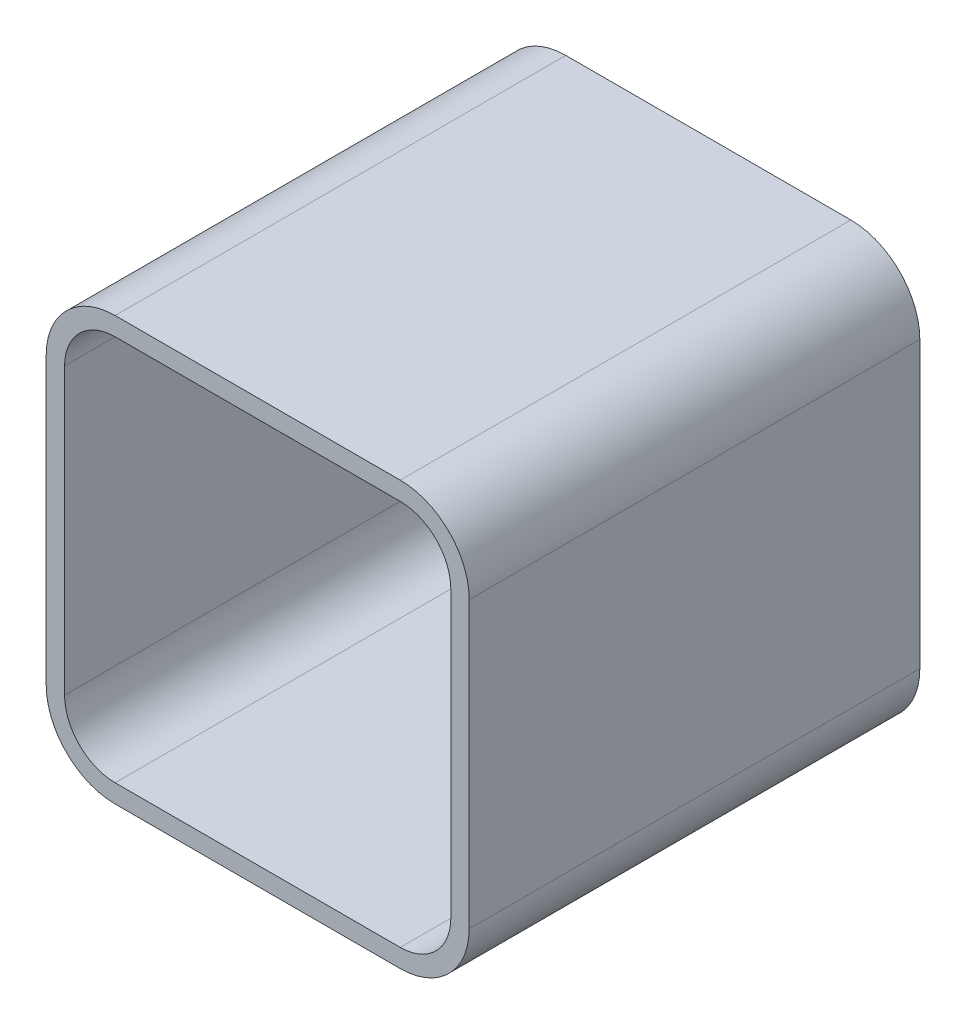
ISO-10303-21;
HEADER;
FILE_DESCRIPTION(('STEP AP214'),'2;1');
FILE_NAME('part.step','',(''),(''),'','','');
FILE_SCHEMA(('AUTOMOTIVE_DESIGN { 1 0 10303 214 1 1 1 1 }'));
ENDSEC;
DATA;
#1=APPLICATION_CONTEXT('core data for automotive mechanical design processes');
#2=APPLICATION_PROTOCOL_DEFINITION('international standard','automotive_design',2000,#1);
#3=PRODUCT_CONTEXT('',#1,'mechanical');
#4=PRODUCT('Part','Part','',(#3));
#5=PRODUCT_RELATED_PRODUCT_CATEGORY('part','',(#4));
#6=PRODUCT_DEFINITION_FORMATION('','',#4);
#7=PRODUCT_DEFINITION_CONTEXT('part definition',#1,'design');
#8=PRODUCT_DEFINITION('design','',#6,#7);
#9=PRODUCT_DEFINITION_SHAPE('','',#8);
#10=(LENGTH_UNIT() NAMED_UNIT(*) SI_UNIT(.MILLI.,.METRE.));
#11=(NAMED_UNIT(*) PLANE_ANGLE_UNIT() SI_UNIT($,.RADIAN.));
#12=(NAMED_UNIT(*) SI_UNIT($,.STERADIAN.) SOLID_ANGLE_UNIT());
#13=UNCERTAINTY_MEASURE_WITH_UNIT(LENGTH_MEASURE(1.E-05),#10,'distance_accuracy_value','');
#14=(GEOMETRIC_REPRESENTATION_CONTEXT(3) GLOBAL_UNCERTAINTY_ASSIGNED_CONTEXT((#13)) GLOBAL_UNIT_ASSIGNED_CONTEXT((#10,
#11,#12)) REPRESENTATION_CONTEXT('',''));
#15=CARTESIAN_POINT('',(0.,0.,0.));
#16=DIRECTION('',(0.,0.,1.));
#17=DIRECTION('',(1.,0.,0.));
#18=AXIS2_PLACEMENT_3D('',#15,#16,#17);
#19=CARTESIAN_POINT('',(0.,0.,2.));
#20=DIRECTION('',(0.,0.,1.));
#21=DIRECTION('',(1.,0.,0.));
#22=AXIS2_PLACEMENT_3D('',#19,#20,#21);
#23=PLANE('',#22);
#24=DIRECTION('',(0.,-1.,0.));
#25=VECTOR('',#24,1.);
#26=CARTESIAN_POINT('',(-21.,-21.,2.));
#27=LINE('',#26,#25);
#28=CARTESIAN_POINT('',(-21.,15.5,2.));
#29=VERTEX_POINT('',#28);
#30=CARTESIAN_POINT('',(-21.,-15.5,2.));
#31=VERTEX_POINT('',#30);
#32=EDGE_CURVE('E170',#29,#31,#27,.T.);
#33=ORIENTED_EDGE('',*,*,#32,.T.);
#34=CARTESIAN_POINT('',(-15.5,-15.5,2.));
#35=DIRECTION('',(0.,0.,1.));
#36=DIRECTION('',(1.,0.,0.));
#37=AXIS2_PLACEMENT_3D('',#34,#35,#36);
#38=CIRCLE('',#37,5.5);
#39=CARTESIAN_POINT('',(-15.5,-21.,2.));
#40=VERTEX_POINT('',#39);
#41=EDGE_CURVE('E11',#31,#40,#38,.T.);
#42=ORIENTED_EDGE('',*,*,#41,.T.);
#43=DIRECTION('',(1.,0.,0.));
#44=VECTOR('',#43,1.);
#45=CARTESIAN_POINT('',(21.,-21.,2.));
#46=LINE('',#45,#44);
#47=CARTESIAN_POINT('',(15.5,-21.,2.));
#48=VERTEX_POINT('',#47);
#49=EDGE_CURVE('E265',#40,#48,#46,.T.);
#50=ORIENTED_EDGE('',*,*,#49,.T.);
#51=CARTESIAN_POINT('',(15.5,-15.5,2.));
#52=DIRECTION('',(0.,0.,1.));
#53=DIRECTION('',(1.,0.,0.));
#54=AXIS2_PLACEMENT_3D('',#51,#52,#53);
#55=CIRCLE('',#54,5.5);
#56=CARTESIAN_POINT('',(21.,-15.5,2.));
#57=VERTEX_POINT('',#56);
#58=EDGE_CURVE('E49',#48,#57,#55,.T.);
#59=ORIENTED_EDGE('',*,*,#58,.T.);
#60=DIRECTION('',(0.,1.,0.));
#61=VECTOR('',#60,1.);
#62=CARTESIAN_POINT('',(21.,-21.,2.));
#63=LINE('',#62,#61);
#64=CARTESIAN_POINT('',(21.,15.5,2.));
#65=VERTEX_POINT('',#64);
#66=EDGE_CURVE('E268',#57,#65,#63,.T.);
#67=ORIENTED_EDGE('',*,*,#66,.T.);
#68=CARTESIAN_POINT('',(15.5,15.5,2.));
#69=DIRECTION('',(0.,0.,1.));
#70=DIRECTION('',(1.,0.,0.));
#71=AXIS2_PLACEMENT_3D('',#68,#69,#70);
#72=CIRCLE('',#71,5.5);
#73=CARTESIAN_POINT('',(15.5,21.,2.));
#74=VERTEX_POINT('',#73);
#75=EDGE_CURVE('E274',#65,#74,#72,.T.);
#76=ORIENTED_EDGE('',*,*,#75,.T.);
#77=DIRECTION('',(-1.,0.,0.));
#78=VECTOR('',#77,1.);
#79=CARTESIAN_POINT('',(21.,21.,2.));
#80=LINE('',#79,#78);
#81=CARTESIAN_POINT('',(-15.5,21.,2.));
#82=VERTEX_POINT('',#81);
#83=EDGE_CURVE('E271',#74,#82,#80,.T.);
#84=ORIENTED_EDGE('',*,*,#83,.T.);
#85=CARTESIAN_POINT('',(-15.5,15.5,2.));
#86=DIRECTION('',(0.,0.,1.));
#87=DIRECTION('',(1.,0.,0.));
#88=AXIS2_PLACEMENT_3D('',#85,#86,#87);
#89=CIRCLE('',#88,5.5);
#90=EDGE_CURVE('E277',#82,#29,#89,.T.);
#91=ORIENTED_EDGE('',*,*,#90,.T.);
#92=EDGE_LOOP('',(#33,#42,#50,#59,#67,#76,#84,#91));
#93=FACE_BOUND('',#92,.T.);
#94=ADVANCED_FACE('F41',(#93),#23,.T.);
#95=CARTESIAN_POINT('',(-15.5,15.5,49.));
#96=DIRECTION('',(0.,0.,1.));
#97=DIRECTION('',(1.,0.,0.));
#98=AXIS2_PLACEMENT_3D('',#95,#96,#97);
#99=PLANE('',#98);
#100=CARTESIAN_POINT('',(-15.5,15.5,49.));
#101=DIRECTION('',(0.,0.,1.));
#102=DIRECTION('',(1.,0.,0.));
#103=AXIS2_PLACEMENT_3D('',#100,#101,#102);
#104=CIRCLE('',#103,7.5);
#105=CARTESIAN_POINT('',(-15.5,23.,49.));
#106=VERTEX_POINT('',#105);
#107=CARTESIAN_POINT('',(-23.,15.5,49.));
#108=VERTEX_POINT('',#107);
#109=EDGE_CURVE('E207',#106,#108,#104,.T.);
#110=ORIENTED_EDGE('',*,*,#109,.T.);
#111=DIRECTION('',(0.,-1.,0.));
#112=VECTOR('',#111,1.);
#113=CARTESIAN_POINT('',(-23.,15.5,49.));
#114=LINE('',#113,#112);
#115=CARTESIAN_POINT('',(-23.,-15.5,49.));
#116=VERTEX_POINT('',#115);
#117=EDGE_CURVE('E210',#108,#116,#114,.T.);
#118=ORIENTED_EDGE('',*,*,#117,.T.);
#119=CARTESIAN_POINT('',(-15.5,-15.5,49.));
#120=DIRECTION('',(0.,0.,1.));
#121=DIRECTION('',(1.,0.,0.));
#122=AXIS2_PLACEMENT_3D('',#119,#120,#121);
#123=CIRCLE('',#122,7.5);
#124=CARTESIAN_POINT('',(-15.5,-23.,49.));
#125=VERTEX_POINT('',#124);
#126=EDGE_CURVE('E213',#116,#125,#123,.T.);
#127=ORIENTED_EDGE('',*,*,#126,.T.);
#128=DIRECTION('',(1.,0.,0.));
#129=VECTOR('',#128,1.);
#130=CARTESIAN_POINT('',(-15.5,-23.,49.));
#131=LINE('',#130,#129);
#132=CARTESIAN_POINT('',(15.5,-23.,49.));
#133=VERTEX_POINT('',#132);
#134=EDGE_CURVE('E215',#125,#133,#131,.T.);
#135=ORIENTED_EDGE('',*,*,#134,.T.);
#136=CARTESIAN_POINT('',(15.5,-15.5,49.));
#137=DIRECTION('',(0.,0.,1.));
#138=DIRECTION('',(1.,0.,0.));
#139=AXIS2_PLACEMENT_3D('',#136,#137,#138);
#140=CIRCLE('',#139,7.5);
#141=CARTESIAN_POINT('',(23.,-15.5,49.));
#142=VERTEX_POINT('',#141);
#143=EDGE_CURVE('E217',#133,#142,#140,.T.);
#144=ORIENTED_EDGE('',*,*,#143,.T.);
#145=DIRECTION('',(0.,1.,0.));
#146=VECTOR('',#145,1.);
#147=CARTESIAN_POINT('',(23.,-15.5,49.));
#148=LINE('',#147,#146);
#149=CARTESIAN_POINT('',(23.,15.5,49.));
#150=VERTEX_POINT('',#149);
#151=EDGE_CURVE('E219',#142,#150,#148,.T.);
#152=ORIENTED_EDGE('',*,*,#151,.T.);
#153=CARTESIAN_POINT('',(15.5,15.5,49.));
#154=DIRECTION('',(0.,0.,1.));
#155=DIRECTION('',(1.,0.,0.));
#156=AXIS2_PLACEMENT_3D('',#153,#154,#155);
#157=CIRCLE('',#156,7.5);
#158=CARTESIAN_POINT('',(15.5,23.,49.));
#159=VERTEX_POINT('',#158);
#160=EDGE_CURVE('E221',#150,#159,#157,.T.);
#161=ORIENTED_EDGE('',*,*,#160,.T.);
#162=DIRECTION('',(-1.,0.,0.));
#163=VECTOR('',#162,1.);
#164=CARTESIAN_POINT('',(15.5,23.,49.));
#165=LINE('',#164,#163);
#166=EDGE_CURVE('E223',#159,#106,#165,.T.);
#167=ORIENTED_EDGE('',*,*,#166,.T.);
#168=EDGE_LOOP('',(#110,#118,#127,#135,#144,#152,#161,#167));
#169=FACE_BOUND('',#168,.T.);
#170=DIRECTION('',(0.,-1.,0.));
#171=VECTOR('',#170,1.);
#172=CARTESIAN_POINT('',(-21.,15.5,49.));
#173=LINE('',#172,#171);
#174=CARTESIAN_POINT('',(-21.,15.5,49.));
#175=VERTEX_POINT('',#174);
#176=CARTESIAN_POINT('',(-21.,-15.5,49.));
#177=VERTEX_POINT('',#176);
#178=EDGE_CURVE('E163',#175,#177,#173,.T.);
#179=ORIENTED_EDGE('',*,*,#178,.F.);
#180=CARTESIAN_POINT('',(-15.5,15.5,49.));
#181=DIRECTION('',(0.,0.,1.));
#182=DIRECTION('',(1.,0.,0.));
#183=AXIS2_PLACEMENT_3D('',#180,#181,#182);
#184=CIRCLE('',#183,5.5);
#185=CARTESIAN_POINT('',(-15.5,21.,49.));
#186=VERTEX_POINT('',#185);
#187=EDGE_CURVE('E155',#186,#175,#184,.T.);
#188=ORIENTED_EDGE('',*,*,#187,.F.);
#189=DIRECTION('',(-1.,0.,0.));
#190=VECTOR('',#189,1.);
#191=CARTESIAN_POINT('',(15.5,21.,49.));
#192=LINE('',#191,#190);
#193=CARTESIAN_POINT('',(15.5,21.,49.));
#194=VERTEX_POINT('',#193);
#195=EDGE_CURVE('E190',#194,#186,#192,.T.);
#196=ORIENTED_EDGE('',*,*,#195,.F.);
#197=CARTESIAN_POINT('',(15.5,15.5,49.));
#198=DIRECTION('',(0.,0.,1.));
#199=DIRECTION('',(1.,0.,0.));
#200=AXIS2_PLACEMENT_3D('',#197,#198,#199);
#201=CIRCLE('',#200,5.5);
#202=CARTESIAN_POINT('',(21.,15.5,49.));
#203=VERTEX_POINT('',#202);
#204=EDGE_CURVE('E187',#203,#194,#201,.T.);
#205=ORIENTED_EDGE('',*,*,#204,.F.);
#206=DIRECTION('',(0.,1.,0.));
#207=VECTOR('',#206,1.);
#208=CARTESIAN_POINT('',(21.,-15.5,49.));
#209=LINE('',#208,#207);
#210=CARTESIAN_POINT('',(21.,-15.5,49.));
#211=VERTEX_POINT('',#210);
#212=EDGE_CURVE('E185',#211,#203,#209,.T.);
#213=ORIENTED_EDGE('',*,*,#212,.F.);
#214=CARTESIAN_POINT('',(15.5,-15.5,49.));
#215=DIRECTION('',(0.,0.,1.));
#216=DIRECTION('',(1.,0.,0.));
#217=AXIS2_PLACEMENT_3D('',#214,#215,#216);
#218=CIRCLE('',#217,5.5);
#219=CARTESIAN_POINT('',(15.5,-21.,49.));
#220=VERTEX_POINT('',#219);
#221=EDGE_CURVE('E183',#220,#211,#218,.T.);
#222=ORIENTED_EDGE('',*,*,#221,.F.);
#223=DIRECTION('',(1.,0.,0.));
#224=VECTOR('',#223,1.);
#225=CARTESIAN_POINT('',(-15.5,-21.,49.));
#226=LINE('',#225,#224);
#227=CARTESIAN_POINT('',(-15.5,-21.,49.));
#228=VERTEX_POINT('',#227);
#229=EDGE_CURVE('E179',#228,#220,#226,.T.);
#230=ORIENTED_EDGE('',*,*,#229,.F.);
#231=CARTESIAN_POINT('',(-15.5,-15.5,49.));
#232=DIRECTION('',(0.,0.,1.));
#233=DIRECTION('',(1.,0.,0.));
#234=AXIS2_PLACEMENT_3D('',#231,#232,#233);
#235=CIRCLE('',#234,5.5);
#236=EDGE_CURVE('E177',#177,#228,#235,.T.);
#237=ORIENTED_EDGE('',*,*,#236,.F.);
#238=EDGE_LOOP('',(#179,#188,#196,#205,#213,#222,#230,#237));
#239=FACE_BOUND('',#238,.T.);
#240=ADVANCED_FACE('F175',(#169,#239),#99,.T.);
#241=CARTESIAN_POINT('',(-15.5,15.5,49.));
#242=DIRECTION('',(0.,0.,-1.));
#243=DIRECTION('',(-1.,0.,0.));
#244=AXIS2_PLACEMENT_3D('',#241,#242,#243);
#245=CYLINDRICAL_SURFACE('',#244,7.5);
#246=CARTESIAN_POINT('',(-15.5,15.5,0.));
#247=DIRECTION('',(0.,0.,1.));
#248=DIRECTION('',(1.,0.,0.));
#249=AXIS2_PLACEMENT_3D('',#246,#247,#248);
#250=CIRCLE('',#249,7.5);
#251=CARTESIAN_POINT('',(-15.5,23.,0.));
#252=VERTEX_POINT('',#251);
#253=CARTESIAN_POINT('',(-23.,15.5,0.));
#254=VERTEX_POINT('',#253);
#255=EDGE_CURVE('E171',#252,#254,#250,.T.);
#256=ORIENTED_EDGE('',*,*,#255,.T.);
#257=DIRECTION('',(0.,0.,-1.));
#258=VECTOR('',#257,1.);
#259=CARTESIAN_POINT('',(-23.,15.5,49.));
#260=LINE('',#259,#258);
#261=EDGE_CURVE('E261',#108,#254,#260,.T.);
#262=ORIENTED_EDGE('',*,*,#261,.F.);
#263=ORIENTED_EDGE('',*,*,#109,.F.);
#264=DIRECTION('',(0.,0.,-1.));
#265=VECTOR('',#264,1.);
#266=CARTESIAN_POINT('',(-15.5,23.,49.));
#267=LINE('',#266,#265);
#268=EDGE_CURVE('E225',#106,#252,#267,.T.);
#269=ORIENTED_EDGE('',*,*,#268,.T.);
#270=EDGE_LOOP('',(#256,#262,#263,#269));
#271=FACE_BOUND('',#270,.T.);
#272=ADVANCED_FACE('F307',(#271),#245,.T.);
#273=CARTESIAN_POINT('',(-23.,15.5,49.));
#274=DIRECTION('',(1.,0.,0.));
#275=DIRECTION('',(0.,0.,-1.));
#276=AXIS2_PLACEMENT_3D('',#273,#274,#275);
#277=PLANE('',#276);
#278=DIRECTION('',(0.,-1.,0.));
#279=VECTOR('',#278,1.);
#280=CARTESIAN_POINT('',(-23.,15.5,0.));
#281=LINE('',#280,#279);
#282=CARTESIAN_POINT('',(-23.,-15.5,0.));
#283=VERTEX_POINT('',#282);
#284=EDGE_CURVE('E228',#254,#283,#281,.T.);
#285=ORIENTED_EDGE('',*,*,#284,.T.);
#286=DIRECTION('',(0.,0.,-1.));
#287=VECTOR('',#286,1.);
#288=CARTESIAN_POINT('',(-23.,-15.5,49.));
#289=LINE('',#288,#287);
#290=EDGE_CURVE('E258',#116,#283,#289,.T.);
#291=ORIENTED_EDGE('',*,*,#290,.F.);
#292=ORIENTED_EDGE('',*,*,#117,.F.);
#293=ORIENTED_EDGE('',*,*,#261,.T.);
#294=EDGE_LOOP('',(#285,#291,#292,#293));
#295=FACE_BOUND('',#294,.T.);
#296=ADVANCED_FACE('F313',(#295),#277,.F.);
#297=CARTESIAN_POINT('',(-15.5,-15.5,49.));
#298=DIRECTION('',(0.,0.,-1.));
#299=DIRECTION('',(-1.,0.,0.));
#300=AXIS2_PLACEMENT_3D('',#297,#298,#299);
#301=CYLINDRICAL_SURFACE('',#300,7.5);
#302=CARTESIAN_POINT('',(-15.5,-15.5,0.));
#303=DIRECTION('',(0.,0.,1.));
#304=DIRECTION('',(1.,0.,0.));
#305=AXIS2_PLACEMENT_3D('',#302,#303,#304);
#306=CIRCLE('',#305,7.5);
#307=CARTESIAN_POINT('',(-15.5,-23.,0.));
#308=VERTEX_POINT('',#307);
#309=EDGE_CURVE('E230',#283,#308,#306,.T.);
#310=ORIENTED_EDGE('',*,*,#309,.T.);
#311=DIRECTION('',(0.,0.,-1.));
#312=VECTOR('',#311,1.);
#313=CARTESIAN_POINT('',(-15.5,-23.,49.));
#314=LINE('',#313,#312);
#315=EDGE_CURVE('E255',#125,#308,#314,.T.);
#316=ORIENTED_EDGE('',*,*,#315,.F.);
#317=ORIENTED_EDGE('',*,*,#126,.F.);
#318=ORIENTED_EDGE('',*,*,#290,.T.);
#319=EDGE_LOOP('',(#310,#316,#317,#318));
#320=FACE_BOUND('',#319,.T.);
#321=ADVANCED_FACE('F317',(#320),#301,.T.);
#322=CARTESIAN_POINT('',(-15.5,-23.,49.));
#323=DIRECTION('',(0.,1.,0.));
#324=DIRECTION('',(-1.,0.,0.));
#325=AXIS2_PLACEMENT_3D('',#322,#323,#324);
#326=PLANE('',#325);
#327=DIRECTION('',(1.,0.,0.));
#328=VECTOR('',#327,1.);
#329=CARTESIAN_POINT('',(-15.5,-23.,0.));
#330=LINE('',#329,#328);
#331=CARTESIAN_POINT('',(15.5,-23.,0.));
#332=VERTEX_POINT('',#331);
#333=EDGE_CURVE('E232',#308,#332,#330,.T.);
#334=ORIENTED_EDGE('',*,*,#333,.T.);
#335=DIRECTION('',(0.,0.,-1.));
#336=VECTOR('',#335,1.);
#337=CARTESIAN_POINT('',(15.5,-23.,49.));
#338=LINE('',#337,#336);
#339=EDGE_CURVE('E252',#133,#332,#338,.T.);
#340=ORIENTED_EDGE('',*,*,#339,.F.);
#341=ORIENTED_EDGE('',*,*,#134,.F.);
#342=ORIENTED_EDGE('',*,*,#315,.T.);
#343=EDGE_LOOP('',(#334,#340,#341,#342));
#344=FACE_BOUND('',#343,.T.);
#345=ADVANCED_FACE('F321',(#344),#326,.F.);
#346=CARTESIAN_POINT('',(15.5,-15.5,49.));
#347=DIRECTION('',(0.,0.,-1.));
#348=DIRECTION('',(-1.,0.,0.));
#349=AXIS2_PLACEMENT_3D('',#346,#347,#348);
#350=CYLINDRICAL_SURFACE('',#349,7.5);
#351=CARTESIAN_POINT('',(15.5,-15.5,0.));
#352=DIRECTION('',(0.,0.,1.));
#353=DIRECTION('',(1.,0.,0.));
#354=AXIS2_PLACEMENT_3D('',#351,#352,#353);
#355=CIRCLE('',#354,7.5);
#356=CARTESIAN_POINT('',(23.,-15.5,0.));
#357=VERTEX_POINT('',#356);
#358=EDGE_CURVE('E234',#332,#357,#355,.T.);
#359=ORIENTED_EDGE('',*,*,#358,.T.);
#360=DIRECTION('',(0.,0.,-1.));
#361=VECTOR('',#360,1.);
#362=CARTESIAN_POINT('',(23.,-15.5,49.));
#363=LINE('',#362,#361);
#364=EDGE_CURVE('E249',#142,#357,#363,.T.);
#365=ORIENTED_EDGE('',*,*,#364,.F.);
#366=ORIENTED_EDGE('',*,*,#143,.F.);
#367=ORIENTED_EDGE('',*,*,#339,.T.);
#368=EDGE_LOOP('',(#359,#365,#366,#367));
#369=FACE_BOUND('',#368,.T.);
#370=ADVANCED_FACE('F325',(#369),#350,.T.);
#371=CARTESIAN_POINT('',(23.,-15.5,49.));
#372=DIRECTION('',(-1.,0.,0.));
#373=DIRECTION('',(0.,-1.,0.));
#374=AXIS2_PLACEMENT_3D('',#371,#372,#373);
#375=PLANE('',#374);
#376=DIRECTION('',(0.,1.,0.));
#377=VECTOR('',#376,1.);
#378=CARTESIAN_POINT('',(23.,-15.5,0.));
#379=LINE('',#378,#377);
#380=CARTESIAN_POINT('',(23.,15.5,0.));
#381=VERTEX_POINT('',#380);
#382=EDGE_CURVE('E236',#357,#381,#379,.T.);
#383=ORIENTED_EDGE('',*,*,#382,.T.);
#384=DIRECTION('',(0.,0.,-1.));
#385=VECTOR('',#384,1.);
#386=CARTESIAN_POINT('',(23.,15.5,49.));
#387=LINE('',#386,#385);
#388=EDGE_CURVE('E246',#150,#381,#387,.T.);
#389=ORIENTED_EDGE('',*,*,#388,.F.);
#390=ORIENTED_EDGE('',*,*,#151,.F.);
#391=ORIENTED_EDGE('',*,*,#364,.T.);
#392=EDGE_LOOP('',(#383,#389,#390,#391));
#393=FACE_BOUND('',#392,.T.);
#394=ADVANCED_FACE('F329',(#393),#375,.F.);
#395=CARTESIAN_POINT('',(15.5,15.5,49.));
#396=DIRECTION('',(0.,0.,-1.));
#397=DIRECTION('',(-1.,0.,0.));
#398=AXIS2_PLACEMENT_3D('',#395,#396,#397);
#399=CYLINDRICAL_SURFACE('',#398,7.5);
#400=CARTESIAN_POINT('',(15.5,15.5,0.));
#401=DIRECTION('',(0.,0.,1.));
#402=DIRECTION('',(1.,0.,0.));
#403=AXIS2_PLACEMENT_3D('',#400,#401,#402);
#404=CIRCLE('',#403,7.5);
#405=CARTESIAN_POINT('',(15.5,23.,0.));
#406=VERTEX_POINT('',#405);
#407=EDGE_CURVE('E238',#381,#406,#404,.T.);
#408=ORIENTED_EDGE('',*,*,#407,.T.);
#409=DIRECTION('',(0.,0.,-1.));
#410=VECTOR('',#409,1.);
#411=CARTESIAN_POINT('',(15.5,23.,49.));
#412=LINE('',#411,#410);
#413=EDGE_CURVE('E243',#159,#406,#412,.T.);
#414=ORIENTED_EDGE('',*,*,#413,.F.);
#415=ORIENTED_EDGE('',*,*,#160,.F.);
#416=ORIENTED_EDGE('',*,*,#388,.T.);
#417=EDGE_LOOP('',(#408,#414,#415,#416));
#418=FACE_BOUND('',#417,.T.);
#419=ADVANCED_FACE('F333',(#418),#399,.T.);
#420=CARTESIAN_POINT('',(15.5,23.,49.));
#421=DIRECTION('',(0.,-1.,0.));
#422=DIRECTION('',(1.,0.,0.));
#423=AXIS2_PLACEMENT_3D('',#420,#421,#422);
#424=PLANE('',#423);
#425=DIRECTION('',(-1.,0.,0.));
#426=VECTOR('',#425,1.);
#427=CARTESIAN_POINT('',(15.5,23.,0.));
#428=LINE('',#427,#426);
#429=EDGE_CURVE('E211',#406,#252,#428,.T.);
#430=ORIENTED_EDGE('',*,*,#429,.T.);
#431=ORIENTED_EDGE('',*,*,#268,.F.);
#432=ORIENTED_EDGE('',*,*,#166,.F.);
#433=ORIENTED_EDGE('',*,*,#413,.T.);
#434=EDGE_LOOP('',(#430,#431,#432,#433));
#435=FACE_BOUND('',#434,.T.);
#436=ADVANCED_FACE('F337',(#435),#424,.F.);
#437=CARTESIAN_POINT('',(-15.5,15.5,49.));
#438=DIRECTION('',(0.,0.,-1.));
#439=DIRECTION('',(-1.,0.,0.));
#440=AXIS2_PLACEMENT_3D('',#437,#438,#439);
#441=CYLINDRICAL_SURFACE('',#440,5.5);
#442=DIRECTION('',(0.,0.,-1.));
#443=VECTOR('',#442,1.);
#444=CARTESIAN_POINT('',(-21.,15.5,49.));
#445=LINE('',#444,#443);
#446=EDGE_CURVE('E158',#175,#29,#445,.T.);
#447=ORIENTED_EDGE('',*,*,#446,.T.);
#448=ORIENTED_EDGE('',*,*,#90,.F.);
#449=DIRECTION('',(0.,0.,-1.));
#450=VECTOR('',#449,1.);
#451=CARTESIAN_POINT('',(-15.5,21.,49.));
#452=LINE('',#451,#450);
#453=EDGE_CURVE('E56',#186,#82,#452,.T.);
#454=ORIENTED_EDGE('',*,*,#453,.F.);
#455=ORIENTED_EDGE('',*,*,#187,.T.);
#456=EDGE_LOOP('',(#447,#448,#454,#455));
#457=FACE_BOUND('',#456,.T.);
#458=ADVANCED_FACE('F157',(#457),#441,.F.);
#459=CARTESIAN_POINT('',(-21.,15.5,49.));
#460=DIRECTION('',(1.,0.,0.));
#461=DIRECTION('',(0.,0.,-1.));
#462=AXIS2_PLACEMENT_3D('',#459,#460,#461);
#463=PLANE('',#462);
#464=DIRECTION('',(0.,0.,-1.));
#465=VECTOR('',#464,1.);
#466=CARTESIAN_POINT('',(-21.,-15.5,49.));
#467=LINE('',#466,#465);
#468=EDGE_CURVE('E172',#177,#31,#467,.T.);
#469=ORIENTED_EDGE('',*,*,#468,.T.);
#470=ORIENTED_EDGE('',*,*,#32,.F.);
#471=ORIENTED_EDGE('',*,*,#446,.F.);
#472=ORIENTED_EDGE('',*,*,#178,.T.);
#473=EDGE_LOOP('',(#469,#470,#471,#472));
#474=FACE_BOUND('',#473,.T.);
#475=ADVANCED_FACE('F167',(#474),#463,.T.);
#476=CARTESIAN_POINT('',(-15.5,-15.5,49.));
#477=DIRECTION('',(0.,0.,-1.));
#478=DIRECTION('',(-1.,0.,0.));
#479=AXIS2_PLACEMENT_3D('',#476,#477,#478);
#480=CYLINDRICAL_SURFACE('',#479,5.5);
#481=DIRECTION('',(0.,0.,-1.));
#482=VECTOR('',#481,1.);
#483=CARTESIAN_POINT('',(-15.5,-21.,49.));
#484=LINE('',#483,#482);
#485=EDGE_CURVE('E203',#228,#40,#484,.T.);
#486=ORIENTED_EDGE('',*,*,#485,.T.);
#487=ORIENTED_EDGE('',*,*,#41,.F.);
#488=ORIENTED_EDGE('',*,*,#468,.F.);
#489=ORIENTED_EDGE('',*,*,#236,.T.);
#490=EDGE_LOOP('',(#486,#487,#488,#489));
#491=FACE_BOUND('',#490,.T.);
#492=ADVANCED_FACE('F283',(#491),#480,.F.);
#493=CARTESIAN_POINT('',(-15.5,-21.,49.));
#494=DIRECTION('',(0.,1.,0.));
#495=DIRECTION('',(-1.,0.,0.));
#496=AXIS2_PLACEMENT_3D('',#493,#494,#495);
#497=PLANE('',#496);
#498=DIRECTION('',(0.,0.,-1.));
#499=VECTOR('',#498,1.);
#500=CARTESIAN_POINT('',(15.5,-21.,49.));
#501=LINE('',#500,#499);
#502=EDGE_CURVE('E201',#220,#48,#501,.T.);
#503=ORIENTED_EDGE('',*,*,#502,.T.);
#504=ORIENTED_EDGE('',*,*,#49,.F.);
#505=ORIENTED_EDGE('',*,*,#485,.F.);
#506=ORIENTED_EDGE('',*,*,#229,.T.);
#507=EDGE_LOOP('',(#503,#504,#505,#506));
#508=FACE_BOUND('',#507,.T.);
#509=ADVANCED_FACE('F281',(#508),#497,.T.);
#510=CARTESIAN_POINT('',(15.5,-15.5,49.));
#511=DIRECTION('',(0.,0.,-1.));
#512=DIRECTION('',(-1.,0.,0.));
#513=AXIS2_PLACEMENT_3D('',#510,#511,#512);
#514=CYLINDRICAL_SURFACE('',#513,5.5);
#515=DIRECTION('',(0.,0.,-1.));
#516=VECTOR('',#515,1.);
#517=CARTESIAN_POINT('',(21.,-15.5,49.));
#518=LINE('',#517,#516);
#519=EDGE_CURVE('E199',#211,#57,#518,.T.);
#520=ORIENTED_EDGE('',*,*,#519,.T.);
#521=ORIENTED_EDGE('',*,*,#58,.F.);
#522=ORIENTED_EDGE('',*,*,#502,.F.);
#523=ORIENTED_EDGE('',*,*,#221,.T.);
#524=EDGE_LOOP('',(#520,#521,#522,#523));
#525=FACE_BOUND('',#524,.T.);
#526=ADVANCED_FACE('F294',(#525),#514,.F.);
#527=CARTESIAN_POINT('',(21.,-15.5,49.));
#528=DIRECTION('',(-1.,0.,0.));
#529=DIRECTION('',(0.,0.,1.));
#530=AXIS2_PLACEMENT_3D('',#527,#528,#529);
#531=PLANE('',#530);
#532=DIRECTION('',(0.,0.,-1.));
#533=VECTOR('',#532,1.);
#534=CARTESIAN_POINT('',(21.,15.5,49.));
#535=LINE('',#534,#533);
#536=EDGE_CURVE('E196',#203,#65,#535,.T.);
#537=ORIENTED_EDGE('',*,*,#536,.T.);
#538=ORIENTED_EDGE('',*,*,#66,.F.);
#539=ORIENTED_EDGE('',*,*,#519,.F.);
#540=ORIENTED_EDGE('',*,*,#212,.T.);
#541=EDGE_LOOP('',(#537,#538,#539,#540));
#542=FACE_BOUND('',#541,.T.);
#543=ADVANCED_FACE('F293',(#542),#531,.T.);
#544=CARTESIAN_POINT('',(15.5,15.5,49.));
#545=DIRECTION('',(0.,0.,-1.));
#546=DIRECTION('',(-1.,0.,0.));
#547=AXIS2_PLACEMENT_3D('',#544,#545,#546);
#548=CYLINDRICAL_SURFACE('',#547,5.5);
#549=DIRECTION('',(0.,0.,-1.));
#550=VECTOR('',#549,1.);
#551=CARTESIAN_POINT('',(15.5,21.,49.));
#552=LINE('',#551,#550);
#553=EDGE_CURVE('E193',#194,#74,#552,.T.);
#554=ORIENTED_EDGE('',*,*,#553,.T.);
#555=ORIENTED_EDGE('',*,*,#75,.F.);
#556=ORIENTED_EDGE('',*,*,#536,.F.);
#557=ORIENTED_EDGE('',*,*,#204,.T.);
#558=EDGE_LOOP('',(#554,#555,#556,#557));
#559=FACE_BOUND('',#558,.T.);
#560=ADVANCED_FACE('F286',(#559),#548,.F.);
#561=CARTESIAN_POINT('',(15.5,21.,49.));
#562=DIRECTION('',(0.,-1.,0.));
#563=DIRECTION('',(1.,0.,0.));
#564=AXIS2_PLACEMENT_3D('',#561,#562,#563);
#565=PLANE('',#564);
#566=ORIENTED_EDGE('',*,*,#453,.T.);
#567=ORIENTED_EDGE('',*,*,#83,.F.);
#568=ORIENTED_EDGE('',*,*,#553,.F.);
#569=ORIENTED_EDGE('',*,*,#195,.T.);
#570=EDGE_LOOP('',(#566,#567,#568,#569));
#571=FACE_BOUND('',#570,.T.);
#572=ADVANCED_FACE('F284',(#571),#565,.T.);
#573=CARTESIAN_POINT('',(0.,0.,0.));
#574=DIRECTION('',(0.,0.,1.));
#575=DIRECTION('',(1.,0.,0.));
#576=AXIS2_PLACEMENT_3D('',#573,#574,#575);
#577=PLANE('',#576);
#578=ORIENTED_EDGE('',*,*,#255,.F.);
#579=ORIENTED_EDGE('',*,*,#429,.F.);
#580=ORIENTED_EDGE('',*,*,#407,.F.);
#581=ORIENTED_EDGE('',*,*,#382,.F.);
#582=ORIENTED_EDGE('',*,*,#358,.F.);
#583=ORIENTED_EDGE('',*,*,#333,.F.);
#584=ORIENTED_EDGE('',*,*,#309,.F.);
#585=ORIENTED_EDGE('',*,*,#284,.F.);
#586=EDGE_LOOP('',(#578,#579,#580,#581,#582,#583,#584,#585));
#587=FACE_BOUND('',#586,.T.);
#588=ADVANCED_FACE('F43',(#587),#577,.F.);
#589=CLOSED_SHELL('',(#94,#240,#272,#296,#321,#345,#370,#394,#419,#436,#458,#475,#492,#509,#526,
#543,#560,#572,#588));
#590=MANIFOLD_SOLID_BREP('B2',#589);
#591=ADVANCED_BREP_SHAPE_REPRESENTATION('',(#18,#590),#14);
#592=SHAPE_DEFINITION_REPRESENTATION(#9,#591);
ENDSEC;
END-ISO-10303-21;
